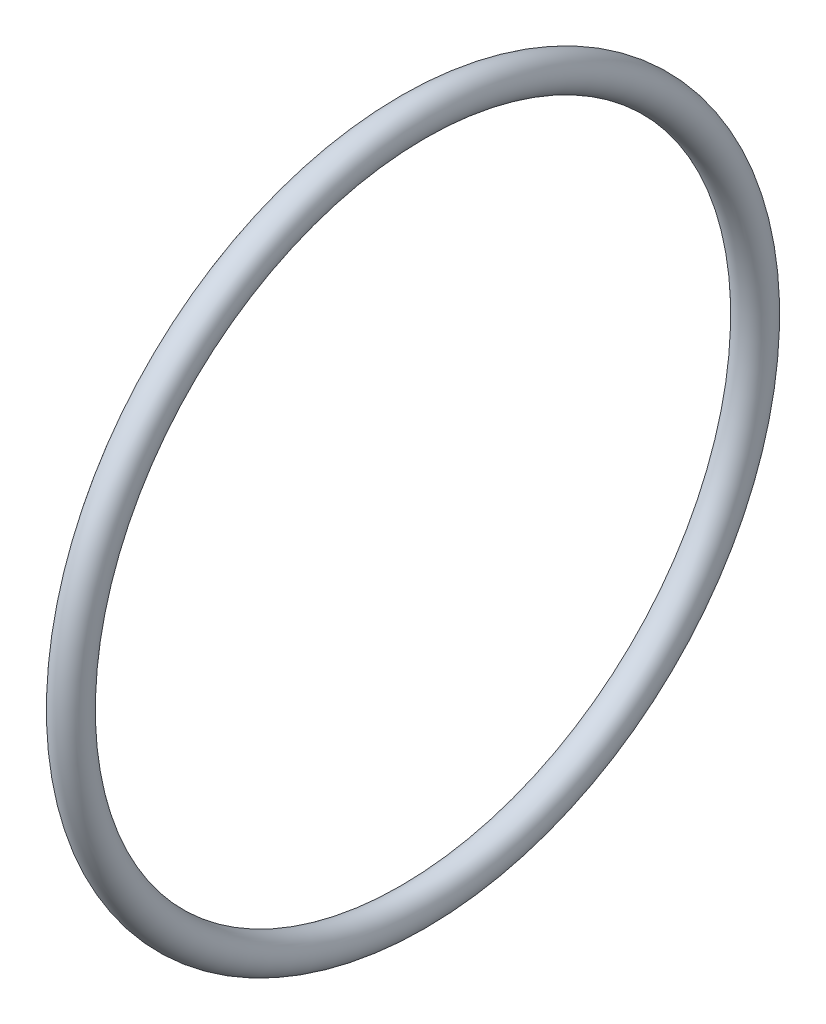
ISO-10303-21;
HEADER;
FILE_DESCRIPTION(('STEP AP214'),'2;1');
FILE_NAME('part.step','',(''),(''),'','','');
FILE_SCHEMA(('AUTOMOTIVE_DESIGN { 1 0 10303 214 1 1 1 1 }'));
ENDSEC;
DATA;
#1=APPLICATION_CONTEXT('core data for automotive mechanical design processes');
#2=APPLICATION_PROTOCOL_DEFINITION('international standard','automotive_design',2000,#1);
#3=PRODUCT_CONTEXT('',#1,'mechanical');
#4=PRODUCT('Part','Part','',(#3));
#5=PRODUCT_RELATED_PRODUCT_CATEGORY('part','',(#4));
#6=PRODUCT_DEFINITION_FORMATION('','',#4);
#7=PRODUCT_DEFINITION_CONTEXT('part definition',#1,'design');
#8=PRODUCT_DEFINITION('design','',#6,#7);
#9=PRODUCT_DEFINITION_SHAPE('','',#8);
#10=(LENGTH_UNIT() NAMED_UNIT(*) SI_UNIT(.MILLI.,.METRE.));
#11=(NAMED_UNIT(*) PLANE_ANGLE_UNIT() SI_UNIT($,.RADIAN.));
#12=(NAMED_UNIT(*) SI_UNIT($,.STERADIAN.) SOLID_ANGLE_UNIT());
#13=UNCERTAINTY_MEASURE_WITH_UNIT(LENGTH_MEASURE(1.E-05),#10,'distance_accuracy_value','');
#14=(GEOMETRIC_REPRESENTATION_CONTEXT(3) GLOBAL_UNCERTAINTY_ASSIGNED_CONTEXT((#13)) GLOBAL_UNIT_ASSIGNED_CONTEXT((#10,
#11,#12)) REPRESENTATION_CONTEXT('',''));
#15=CARTESIAN_POINT('',(0.,0.,0.));
#16=DIRECTION('',(0.,0.,1.));
#17=DIRECTION('',(1.,0.,0.));
#18=AXIS2_PLACEMENT_3D('',#15,#16,#17);
#19=CARTESIAN_POINT('',(-16.5099999999998,1432.78731013692,0.));
#20=DIRECTION('',(-1.,0.,0.));
#21=DIRECTION('',(0.,-1.,0.));
#22=AXIS2_PLACEMENT_3D('',#19,#20,#21);
#23=TOROIDAL_SURFACE('',#22,12.5476000000001,0.63499999999993);
#24=CARTESIAN_POINT('',(-16.5099999999996,1419.60471013692,0.));
#25=VERTEX_POINT('',#24);
#26=VERTEX_LOOP('',#25);
#27=FACE_BOUND('',#26,.T.);
#28=ADVANCED_FACE('F32',(#27),#23,.T.);
#29=CLOSED_SHELL('',(#28));
#30=MANIFOLD_SOLID_BREP('B2',#29);
#31=ADVANCED_BREP_SHAPE_REPRESENTATION('',(#18,#30),#14);
#32=SHAPE_DEFINITION_REPRESENTATION(#9,#31);
ENDSEC;
END-ISO-10303-21;
